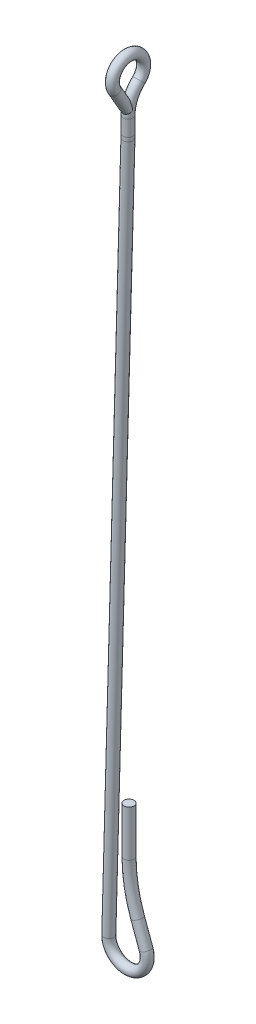
ISO-10303-21;
HEADER;
FILE_DESCRIPTION(('STEP AP214'),'2;1');
FILE_NAME('part.step','',(''),(''),'','','');
FILE_SCHEMA(('AUTOMOTIVE_DESIGN { 1 0 10303 214 1 1 1 1 }'));
ENDSEC;
DATA;
#1=APPLICATION_CONTEXT('core data for automotive mechanical design processes');
#2=APPLICATION_PROTOCOL_DEFINITION('international standard','automotive_design',2000,#1);
#3=PRODUCT_CONTEXT('',#1,'mechanical');
#4=PRODUCT('Part','Part','',(#3));
#5=PRODUCT_RELATED_PRODUCT_CATEGORY('part','',(#4));
#6=PRODUCT_DEFINITION_FORMATION('','',#4);
#7=PRODUCT_DEFINITION_CONTEXT('part definition',#1,'design');
#8=PRODUCT_DEFINITION('design','',#6,#7);
#9=PRODUCT_DEFINITION_SHAPE('','',#8);
#10=(LENGTH_UNIT() NAMED_UNIT(*) SI_UNIT(.MILLI.,.METRE.));
#11=(NAMED_UNIT(*) PLANE_ANGLE_UNIT() SI_UNIT($,.RADIAN.));
#12=(NAMED_UNIT(*) SI_UNIT($,.STERADIAN.) SOLID_ANGLE_UNIT());
#13=UNCERTAINTY_MEASURE_WITH_UNIT(LENGTH_MEASURE(1.E-05),#10,'distance_accuracy_value','');
#14=(GEOMETRIC_REPRESENTATION_CONTEXT(3) GLOBAL_UNCERTAINTY_ASSIGNED_CONTEXT((#13)) GLOBAL_UNIT_ASSIGNED_CONTEXT((#10,
#11,#12)) REPRESENTATION_CONTEXT('',''));
#15=CARTESIAN_POINT('',(0.,0.,0.));
#16=DIRECTION('',(0.,0.,1.));
#17=DIRECTION('',(1.,0.,0.));
#18=AXIS2_PLACEMENT_3D('',#15,#16,#17);
#19=CARTESIAN_POINT('',(0.364498200868611,56.5824106199902,0.));
#20=DIRECTION('',(0.,1.,0.));
#21=DIRECTION('',(-1.,0.,0.));
#22=AXIS2_PLACEMENT_3D('',#19,#20,#21);
#23=CYLINDRICAL_SURFACE('',#22,1.778);
#24=CARTESIAN_POINT('',(0.364498200868611,56.5824106199902,0.));
#25=DIRECTION('',(0.,-1.,0.));
#26=DIRECTION('',(0.,0.,1.));
#27=AXIS2_PLACEMENT_3D('',#24,#25,#26);
#28=CIRCLE('',#27,1.778);
#29=CARTESIAN_POINT('',(-1.41350179913138,56.5824106199902,0.));
#30=VERTEX_POINT('',#29);
#31=EDGE_CURVE('E36',#30,#30,#28,.T.);
#32=ORIENTED_EDGE('',*,*,#31,.F.);
#33=EDGE_LOOP('',(#32));
#34=FACE_BOUND('',#33,.T.);
#35=CARTESIAN_POINT('',(0.364498200868615,73.0250000000001,0.));
#36=DIRECTION('',(0.,-1.,0.));
#37=DIRECTION('',(0.,0.,1.));
#38=AXIS2_PLACEMENT_3D('',#35,#36,#37);
#39=CIRCLE('',#38,1.778);
#40=CARTESIAN_POINT('',(0.364498200868615,73.0250000000001,1.778));
#41=VERTEX_POINT('',#40);
#42=EDGE_CURVE('E10',#41,#41,#39,.T.);
#43=ORIENTED_EDGE('',*,*,#42,.T.);
#44=EDGE_LOOP('',(#43));
#45=FACE_BOUND('',#44,.T.);
#46=ADVANCED_FACE('F30',(#34,#45),#23,.T.);
#47=CARTESIAN_POINT('',(51.1644982008686,56.5824106199901,0.));
#48=DIRECTION('',(0.,0.,-1.));
#49=DIRECTION('',(-1.,0.,0.));
#50=AXIS2_PLACEMENT_3D('',#47,#48,#49);
#51=TOROIDAL_SURFACE('',#50,50.8,1.778);
#52=CARTESIAN_POINT('',(3.42811306494446,39.2077873390461,0.));
#53=DIRECTION('',(0.342020143325684,-0.939692620785903,0.));
#54=DIRECTION('',(0.,0.,1.));
#55=AXIS2_PLACEMENT_3D('',#52,#53,#54);
#56=CIRCLE('',#55,1.778);
#57=CARTESIAN_POINT('',(1.75733958518712,38.5996755242131,0.));
#58=VERTEX_POINT('',#57);
#59=EDGE_CURVE('E40',#58,#58,#56,.T.);
#60=CARTESIAN_POINT('',(51.1644982008686,56.5824106199901,0.));
#61=DIRECTION('',(0.,0.,-1.));
#62=DIRECTION('',(-1.,0.,0.));
#63=AXIS2_PLACEMENT_3D('',#60,#61,#62);
#64=CIRCLE('',#63,52.578);
#65=EDGE_CURVE('',#58,#30,#64,.T.);
#66=ORIENTED_EDGE('',*,*,#59,.F.);
#67=ORIENTED_EDGE('',*,*,#31,.T.);
#68=ORIENTED_EDGE('',*,*,#65,.T.);
#69=ORIENTED_EDGE('',*,*,#65,.F.);
#70=EDGE_LOOP('',(#66,#68,#67,#69));
#71=FACE_BOUND('',#70,.T.);
#72=ADVANCED_FACE('F98',(#71),#51,.T.);
#73=CARTESIAN_POINT('',(6.44441199334973,30.9205741429275,0.));
#74=DIRECTION('',(-0.342020143325671,0.939692620785907,0.));
#75=DIRECTION('',(-0.939692620785908,-0.342020143325671,0.));
#76=AXIS2_PLACEMENT_3D('',#73,#74,#75);
#77=CYLINDRICAL_SURFACE('',#76,1.778);
#78=CARTESIAN_POINT('',(6.44441199334973,30.9205741429275,0.));
#79=DIRECTION('',(0.342020143325684,-0.939692620785903,0.));
#80=DIRECTION('',(0.,0.,1.));
#81=AXIS2_PLACEMENT_3D('',#78,#79,#80);
#82=CIRCLE('',#81,1.778);
#83=CARTESIAN_POINT('',(8.11518547310706,31.5286859577606,0.));
#84=VERTEX_POINT('',#83);
#85=EDGE_CURVE('E44',#84,#84,#82,.T.);
#86=ORIENTED_EDGE('',*,*,#85,.F.);
#87=EDGE_LOOP('',(#86));
#88=FACE_BOUND('',#87,.T.);
#89=ORIENTED_EDGE('',*,*,#59,.T.);
#90=EDGE_LOOP('',(#89));
#91=FACE_BOUND('',#90,.T.);
#92=ADVANCED_FACE('F103',(#88,#91),#77,.T.);
#93=CARTESIAN_POINT('',(0.,28.575,0.));
#94=DIRECTION('',(0.,0.,1.));
#95=DIRECTION('',(1.,0.,0.));
#96=AXIS2_PLACEMENT_3D('',#93,#94,#95);
#97=TOROIDAL_SURFACE('',#96,6.858,1.778);
#98=CARTESIAN_POINT('',(-6.85543609461652,28.7625098734177,0.));
#99=DIRECTION('',(0.0273417721518989,0.999626143863591,0.));
#100=DIRECTION('',(0.,0.,1.));
#101=AXIS2_PLACEMENT_3D('',#98,#99,#100);
#102=CIRCLE('',#101,1.778);
#103=CARTESIAN_POINT('',(-8.63277137840598,28.8111235443038,0.));
#104=VERTEX_POINT('',#103);
#105=EDGE_CURVE('E49',#104,#104,#102,.T.);
#106=CARTESIAN_POINT('',(0.,28.575,0.));
#107=DIRECTION('',(0.,0.,1.));
#108=DIRECTION('',(1.,0.,0.));
#109=AXIS2_PLACEMENT_3D('',#106,#107,#108);
#110=CIRCLE('',#109,8.636);
#111=EDGE_CURVE('',#104,#84,#110,.T.);
#112=ORIENTED_EDGE('',*,*,#105,.F.);
#113=ORIENTED_EDGE('',*,*,#85,.T.);
#114=ORIENTED_EDGE('',*,*,#111,.T.);
#115=ORIENTED_EDGE('',*,*,#111,.F.);
#116=EDGE_LOOP('',(#112,#114,#113,#115));
#117=FACE_BOUND('',#116,.T.);
#118=ADVANCED_FACE('F108',(#117),#97,.T.);
#119=CARTESIAN_POINT('',(-0.0189918917295516,278.705648829607,0.));
#120=DIRECTION('',(-0.0273417721518988,-0.999626143863591,0.));
#121=DIRECTION('',(0.999626143863591,-0.0273417721518988,0.));
#122=AXIS2_PLACEMENT_3D('',#119,#120,#121);
#123=CYLINDRICAL_SURFACE('',#122,1.778);
#124=CARTESIAN_POINT('',(-0.0189918917295516,278.705648829607,0.));
#125=DIRECTION('',(0.0273417721518989,0.999626143863591,0.));
#126=DIRECTION('',(0.,0.,1.));
#127=AXIS2_PLACEMENT_3D('',#124,#125,#126);
#128=CIRCLE('',#127,1.778);
#129=CARTESIAN_POINT('',(1.75834339205991,278.657035158721,0.));
#130=VERTEX_POINT('',#129);
#131=EDGE_CURVE('E52',#130,#130,#128,.T.);
#132=ORIENTED_EDGE('',*,*,#131,.F.);
#133=EDGE_LOOP('',(#132));
#134=FACE_BOUND('',#133,.T.);
#135=ORIENTED_EDGE('',*,*,#105,.T.);
#136=EDGE_LOOP('',(#135));
#137=FACE_BOUND('',#136,.T.);
#138=ADVANCED_FACE('F94',(#134,#137),#123,.T.);
#139=CARTESIAN_POINT('',(-50.8,280.094610854923,0.));
#140=DIRECTION('',(0.,0.,-1.));
#141=DIRECTION('',(-1.,0.,0.));
#142=AXIS2_PLACEMENT_3D('',#139,#140,#141);
#143=TOROIDAL_SURFACE('',#142,50.8,1.778);
#144=CARTESIAN_POINT('',(0.,280.094610854923,0.));
#145=DIRECTION('',(0.,1.,0.));
#146=DIRECTION('',(0.,0.,1.));
#147=AXIS2_PLACEMENT_3D('',#144,#145,#146);
#148=CIRCLE('',#147,1.778);
#149=CARTESIAN_POINT('',(1.778,280.094610854923,0.));
#150=VERTEX_POINT('',#149);
#151=EDGE_CURVE('E55',#150,#150,#148,.T.);
#152=CARTESIAN_POINT('',(-50.8,280.094610854923,0.));
#153=DIRECTION('',(0.,0.,-1.));
#154=DIRECTION('',(-1.,0.,0.));
#155=AXIS2_PLACEMENT_3D('',#152,#153,#154);
#156=CIRCLE('',#155,52.578);
#157=EDGE_CURVE('',#150,#130,#156,.T.);
#158=ORIENTED_EDGE('',*,*,#151,.F.);
#159=ORIENTED_EDGE('',*,*,#131,.T.);
#160=ORIENTED_EDGE('',*,*,#157,.T.);
#161=ORIENTED_EDGE('',*,*,#157,.F.);
#162=EDGE_LOOP('',(#158,#160,#159,#161));
#163=FACE_BOUND('',#162,.T.);
#164=ADVANCED_FACE('F84',(#163),#143,.T.);
#165=CARTESIAN_POINT('',(0.,280.094610854923,0.));
#166=DIRECTION('',(0.,1.,0.));
#167=DIRECTION('',(0.,0.,1.));
#168=AXIS2_PLACEMENT_3D('',#165,#166,#167);
#169=CYLINDRICAL_SURFACE('',#168,1.778);
#170=ORIENTED_EDGE('',*,*,#151,.T.);
#171=EDGE_LOOP('',(#170));
#172=FACE_BOUND('',#171,.T.);
#173=CARTESIAN_POINT('',(0.,285.75,0.));
#174=DIRECTION('',(0.,1.,0.));
#175=DIRECTION('',(0.,0.,1.));
#176=AXIS2_PLACEMENT_3D('',#173,#174,#175);
#177=CIRCLE('',#176,1.778);
#178=CARTESIAN_POINT('',(0.,285.75,1.778));
#179=VERTEX_POINT('',#178);
#180=EDGE_CURVE('E56',#179,#179,#177,.T.);
#181=ORIENTED_EDGE('',*,*,#180,.F.);
#182=EDGE_LOOP('',(#181));
#183=FACE_BOUND('',#182,.T.);
#184=ADVANCED_FACE('F81',(#172,#183),#169,.T.);
#185=CARTESIAN_POINT('',(0.364498200868615,73.0250000000001,0.));
#186=DIRECTION('',(0.,-1.,0.));
#187=DIRECTION('',(0.,0.,1.));
#188=AXIS2_PLACEMENT_3D('',#185,#186,#187);
#189=PLANE('',#188);
#190=ORIENTED_EDGE('',*,*,#42,.F.);
#191=EDGE_LOOP('',(#190));
#192=FACE_BOUND('',#191,.T.);
#193=ADVANCED_FACE('F83',(#192),#189,.F.);
#194=CARTESIAN_POINT('',(0.,295.91,4.83934995634744));
#195=DIRECTION('',(0.,-0.866025403784441,-0.499999999999996));
#196=DIRECTION('',(0.,0.499999999999996,-0.866025403784441));
#197=AXIS2_PLACEMENT_3D('',#194,#195,#196);
#198=CYLINDRICAL_SURFACE('',#197,1.778);
#199=CARTESIAN_POINT('',(0.,295.91,4.83934995634744));
#200=DIRECTION('',(0.,-0.866025403784435,-0.500000000000007));
#201=DIRECTION('',(0.,0.500000000000007,-0.866025403784435));
#202=AXIS2_PLACEMENT_3D('',#199,#200,#201);
#203=CIRCLE('',#202,1.778);
#204=CARTESIAN_POINT('',(0.,295.021,6.37914312427616));
#205=VERTEX_POINT('',#204);
#206=EDGE_CURVE('E64',#205,#205,#203,.T.);
#207=ORIENTED_EDGE('',*,*,#206,.T.);
#208=EDGE_LOOP('',(#207));
#209=FACE_BOUND('',#208,.T.);
#210=CARTESIAN_POINT('',(0.,287.967940905122,0.253999999999984));
#211=DIRECTION('',(0.,-0.866025403784435,-0.500000000000007));
#212=DIRECTION('',(0.,0.500000000000007,-0.866025403784435));
#213=AXIS2_PLACEMENT_3D('',#210,#211,#212);
#214=CIRCLE('',#213,1.778);
#215=CARTESIAN_POINT('',(0.,288.856940905122,-1.28579316792874));
#216=VERTEX_POINT('',#215);
#217=EDGE_CURVE('E59',#216,#216,#214,.T.);
#218=ORIENTED_EDGE('',*,*,#217,.F.);
#219=EDGE_LOOP('',(#218));
#220=FACE_BOUND('',#219,.T.);
#221=ADVANCED_FACE('F91',(#209,#220),#198,.T.);
#222=CARTESIAN_POINT('',(0.,298.704,0.));
#223=DIRECTION('',(1.,0.,0.));
#224=DIRECTION('',(0.,0.,-1.));
#225=AXIS2_PLACEMENT_3D('',#222,#223,#224);
#226=TOROIDAL_SURFACE('',#225,5.58799999999999,1.778);
#227=CARTESIAN_POINT('',(0.,294.639341329011,-3.83461782820096));
#228=DIRECTION('',(0.,0.686223662884928,-0.72739059967585));
#229=DIRECTION('',(0.,0.72739059967585,0.686223662884928));
#230=AXIS2_PLACEMENT_3D('',#227,#228,#229);
#231=CIRCLE('',#230,1.778);
#232=CARTESIAN_POINT('',(0.,293.346040842788,-5.05472350081036));
#233=VERTEX_POINT('',#232);
#234=EDGE_CURVE('E67',#233,#233,#231,.T.);
#235=CARTESIAN_POINT('',(0.,298.704,0.));
#236=DIRECTION('',(1.,0.,0.));
#237=DIRECTION('',(0.,0.,-1.));
#238=AXIS2_PLACEMENT_3D('',#235,#236,#237);
#239=CIRCLE('',#238,7.36599999999999);
#240=EDGE_CURVE('',#233,#205,#239,.T.);
#241=ORIENTED_EDGE('',*,*,#234,.T.);
#242=ORIENTED_EDGE('',*,*,#206,.F.);
#243=ORIENTED_EDGE('',*,*,#240,.T.);
#244=ORIENTED_EDGE('',*,*,#240,.F.);
#245=EDGE_LOOP('',(#241,#243,#242,#244));
#246=FACE_BOUND('',#245,.T.);
#247=ADVANCED_FACE('F71',(#246),#226,.T.);
#248=CARTESIAN_POINT('',(0.,285.75,-12.2208636363637));
#249=DIRECTION('',(1.,0.,0.));
#250=DIRECTION('',(0.,0.,-1.));
#251=AXIS2_PLACEMENT_3D('',#248,#249,#250);
#252=TOROIDAL_SURFACE('',#251,12.2208636363637,1.778);
#253=ORIENTED_EDGE('',*,*,#234,.F.);
#254=EDGE_LOOP('',(#253));
#255=FACE_BOUND('',#254,.T.);
#256=ORIENTED_EDGE('',*,*,#180,.T.);
#257=EDGE_LOOP('',(#256));
#258=FACE_BOUND('',#257,.T.);
#259=ADVANCED_FACE('F74',(#255,#258),#252,.T.);
#260=CARTESIAN_POINT('',(0.,287.967940905122,0.253999999999984));
#261=DIRECTION('',(0.,-0.866025403784435,-0.500000000000007));
#262=DIRECTION('',(0.,0.500000000000007,-0.866025403784435));
#263=AXIS2_PLACEMENT_3D('',#260,#261,#262);
#264=PLANE('',#263);
#265=ORIENTED_EDGE('',*,*,#217,.T.);
#266=EDGE_LOOP('',(#265));
#267=FACE_BOUND('',#266,.T.);
#268=ADVANCED_FACE('F77',(#267),#264,.T.);
#269=CLOSED_SHELL('',(#46,#72,#92,#118,#138,#164,#184,#193,#221,#247,#259,#268));
#270=MANIFOLD_SOLID_BREP('B2',#269);
#271=ADVANCED_BREP_SHAPE_REPRESENTATION('',(#18,#270),#14);
#272=SHAPE_DEFINITION_REPRESENTATION(#9,#271);
ENDSEC;
END-ISO-10303-21;
